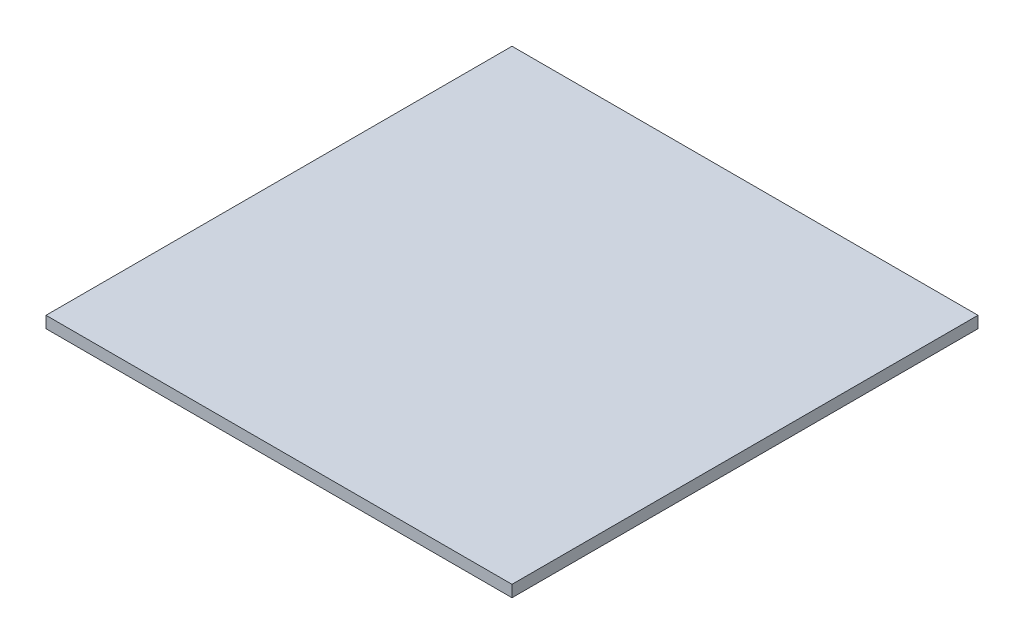
ISO-10303-21;
HEADER;
FILE_DESCRIPTION(('STEP AP214'),'2;1');
FILE_NAME('part.step','',(''),(''),'','','');
FILE_SCHEMA(('AUTOMOTIVE_DESIGN { 1 0 10303 214 1 1 1 1 }'));
ENDSEC;
DATA;
#1=APPLICATION_CONTEXT('core data for automotive mechanical design processes');
#2=APPLICATION_PROTOCOL_DEFINITION('international standard','automotive_design',2000,#1);
#3=PRODUCT_CONTEXT('',#1,'mechanical');
#4=PRODUCT('Part','Part','',(#3));
#5=PRODUCT_RELATED_PRODUCT_CATEGORY('part','',(#4));
#6=PRODUCT_DEFINITION_FORMATION('','',#4);
#7=PRODUCT_DEFINITION_CONTEXT('part definition',#1,'design');
#8=PRODUCT_DEFINITION('design','',#6,#7);
#9=PRODUCT_DEFINITION_SHAPE('','',#8);
#10=(LENGTH_UNIT() NAMED_UNIT(*) SI_UNIT(.MILLI.,.METRE.));
#11=(NAMED_UNIT(*) PLANE_ANGLE_UNIT() SI_UNIT($,.RADIAN.));
#12=(NAMED_UNIT(*) SI_UNIT($,.STERADIAN.) SOLID_ANGLE_UNIT());
#13=UNCERTAINTY_MEASURE_WITH_UNIT(LENGTH_MEASURE(1.E-05),#10,'distance_accuracy_value','');
#14=(GEOMETRIC_REPRESENTATION_CONTEXT(3) GLOBAL_UNCERTAINTY_ASSIGNED_CONTEXT((#13)) GLOBAL_UNIT_ASSIGNED_CONTEXT((#10,
#11,#12)) REPRESENTATION_CONTEXT('',''));
#15=CARTESIAN_POINT('',(0.,0.,0.));
#16=DIRECTION('',(0.,0.,1.));
#17=DIRECTION('',(1.,0.,0.));
#18=AXIS2_PLACEMENT_3D('',#15,#16,#17);
#19=CARTESIAN_POINT('',(-200.,10.,-200.));
#20=DIRECTION('',(1.,0.,0.));
#21=DIRECTION('',(0.,0.,-1.));
#22=AXIS2_PLACEMENT_3D('',#19,#20,#21);
#23=PLANE('',#22);
#24=DIRECTION('',(0.,0.,1.));
#25=VECTOR('',#24,1.);
#26=CARTESIAN_POINT('',(-200.,0.,-200.));
#27=LINE('',#26,#25);
#28=CARTESIAN_POINT('',(-200.,0.,-200.));
#29=VERTEX_POINT('',#28);
#30=CARTESIAN_POINT('',(-200.,0.,200.));
#31=VERTEX_POINT('',#30);
#32=EDGE_CURVE('E97',#29,#31,#27,.T.);
#33=ORIENTED_EDGE('',*,*,#32,.T.);
#34=DIRECTION('',(0.,-1.,0.));
#35=VECTOR('',#34,1.);
#36=CARTESIAN_POINT('',(-200.,10.,200.));
#37=LINE('',#36,#35);
#38=CARTESIAN_POINT('',(-200.,10.,200.));
#39=VERTEX_POINT('',#38);
#40=EDGE_CURVE('E11',#39,#31,#37,.T.);
#41=ORIENTED_EDGE('',*,*,#40,.F.);
#42=DIRECTION('',(0.,0.,1.));
#43=VECTOR('',#42,1.);
#44=CARTESIAN_POINT('',(-200.,10.,-200.));
#45=LINE('',#44,#43);
#46=CARTESIAN_POINT('',(-200.,10.,-200.));
#47=VERTEX_POINT('',#46);
#48=EDGE_CURVE('E85',#47,#39,#45,.T.);
#49=ORIENTED_EDGE('',*,*,#48,.F.);
#50=DIRECTION('',(0.,-1.,0.));
#51=VECTOR('',#50,1.);
#52=CARTESIAN_POINT('',(-200.,10.,-200.));
#53=LINE('',#52,#51);
#54=EDGE_CURVE('E93',#47,#29,#53,.T.);
#55=ORIENTED_EDGE('',*,*,#54,.T.);
#56=EDGE_LOOP('',(#33,#41,#49,#55));
#57=FACE_BOUND('',#56,.T.);
#58=ADVANCED_FACE('F34',(#57),#23,.F.);
#59=CARTESIAN_POINT('',(-200.,10.,200.));
#60=DIRECTION('',(0.,0.,-1.));
#61=DIRECTION('',(-1.,0.,0.));
#62=AXIS2_PLACEMENT_3D('',#59,#60,#61);
#63=PLANE('',#62);
#64=DIRECTION('',(1.,0.,0.));
#65=VECTOR('',#64,1.);
#66=CARTESIAN_POINT('',(-200.,0.,200.));
#67=LINE('',#66,#65);
#68=CARTESIAN_POINT('',(200.,0.,200.));
#69=VERTEX_POINT('',#68);
#70=EDGE_CURVE('E89',#31,#69,#67,.T.);
#71=ORIENTED_EDGE('',*,*,#70,.T.);
#72=DIRECTION('',(0.,-1.,0.));
#73=VECTOR('',#72,1.);
#74=CARTESIAN_POINT('',(200.,10.,200.));
#75=LINE('',#74,#73);
#76=CARTESIAN_POINT('',(200.,10.,200.));
#77=VERTEX_POINT('',#76);
#78=EDGE_CURVE('E42',#77,#69,#75,.T.);
#79=ORIENTED_EDGE('',*,*,#78,.F.);
#80=DIRECTION('',(1.,0.,0.));
#81=VECTOR('',#80,1.);
#82=CARTESIAN_POINT('',(-200.,10.,200.));
#83=LINE('',#82,#81);
#84=EDGE_CURVE('E80',#39,#77,#83,.T.);
#85=ORIENTED_EDGE('',*,*,#84,.F.);
#86=ORIENTED_EDGE('',*,*,#40,.T.);
#87=EDGE_LOOP('',(#71,#79,#85,#86));
#88=FACE_BOUND('',#87,.T.);
#89=ADVANCED_FACE('F88',(#88),#63,.F.);
#90=CARTESIAN_POINT('',(200.,10.,-200.));
#91=DIRECTION('',(-1.,0.,0.));
#92=DIRECTION('',(0.,0.,1.));
#93=AXIS2_PLACEMENT_3D('',#90,#91,#92);
#94=PLANE('',#93);
#95=DIRECTION('',(0.,0.,-1.));
#96=VECTOR('',#95,1.);
#97=CARTESIAN_POINT('',(200.,0.,-200.));
#98=LINE('',#97,#96);
#99=CARTESIAN_POINT('',(200.,0.,-200.));
#100=VERTEX_POINT('',#99);
#101=EDGE_CURVE('E67',#69,#100,#98,.T.);
#102=ORIENTED_EDGE('',*,*,#101,.T.);
#103=DIRECTION('',(0.,-1.,0.));
#104=VECTOR('',#103,1.);
#105=CARTESIAN_POINT('',(200.,10.,-200.));
#106=LINE('',#105,#104);
#107=CARTESIAN_POINT('',(200.,10.,-200.));
#108=VERTEX_POINT('',#107);
#109=EDGE_CURVE('E90',#108,#100,#106,.T.);
#110=ORIENTED_EDGE('',*,*,#109,.F.);
#111=DIRECTION('',(0.,0.,-1.));
#112=VECTOR('',#111,1.);
#113=CARTESIAN_POINT('',(200.,10.,-200.));
#114=LINE('',#113,#112);
#115=EDGE_CURVE('E83',#77,#108,#114,.T.);
#116=ORIENTED_EDGE('',*,*,#115,.F.);
#117=ORIENTED_EDGE('',*,*,#78,.T.);
#118=EDGE_LOOP('',(#102,#110,#116,#117));
#119=FACE_BOUND('',#118,.T.);
#120=ADVANCED_FACE('F91',(#119),#94,.F.);
#121=CARTESIAN_POINT('',(-200.,10.,-200.));
#122=DIRECTION('',(0.,0.,1.));
#123=DIRECTION('',(1.,0.,0.));
#124=AXIS2_PLACEMENT_3D('',#121,#122,#123);
#125=PLANE('',#124);
#126=DIRECTION('',(-1.,0.,0.));
#127=VECTOR('',#126,1.);
#128=CARTESIAN_POINT('',(-200.,0.,-200.));
#129=LINE('',#128,#127);
#130=EDGE_CURVE('E73',#100,#29,#129,.T.);
#131=ORIENTED_EDGE('',*,*,#130,.T.);
#132=ORIENTED_EDGE('',*,*,#54,.F.);
#133=DIRECTION('',(-1.,0.,0.));
#134=VECTOR('',#133,1.);
#135=CARTESIAN_POINT('',(-200.,10.,-200.));
#136=LINE('',#135,#134);
#137=EDGE_CURVE('E50',#108,#47,#136,.T.);
#138=ORIENTED_EDGE('',*,*,#137,.F.);
#139=ORIENTED_EDGE('',*,*,#109,.T.);
#140=EDGE_LOOP('',(#131,#132,#138,#139));
#141=FACE_BOUND('',#140,.T.);
#142=ADVANCED_FACE('F104',(#141),#125,.F.);
#143=CARTESIAN_POINT('',(0.,10.,0.));
#144=DIRECTION('',(0.,1.,0.));
#145=DIRECTION('',(0.,0.,1.));
#146=AXIS2_PLACEMENT_3D('',#143,#144,#145);
#147=PLANE('',#146);
#148=ORIENTED_EDGE('',*,*,#48,.T.);
#149=ORIENTED_EDGE('',*,*,#84,.T.);
#150=ORIENTED_EDGE('',*,*,#115,.T.);
#151=ORIENTED_EDGE('',*,*,#137,.T.);
#152=EDGE_LOOP('',(#148,#149,#150,#151));
#153=FACE_BOUND('',#152,.T.);
#154=ADVANCED_FACE('F81',(#153),#147,.T.);
#155=CARTESIAN_POINT('',(0.,0.,0.));
#156=DIRECTION('',(0.,1.,0.));
#157=DIRECTION('',(0.,0.,1.));
#158=AXIS2_PLACEMENT_3D('',#155,#156,#157);
#159=PLANE('',#158);
#160=ORIENTED_EDGE('',*,*,#32,.F.);
#161=ORIENTED_EDGE('',*,*,#130,.F.);
#162=ORIENTED_EDGE('',*,*,#101,.F.);
#163=ORIENTED_EDGE('',*,*,#70,.F.);
#164=EDGE_LOOP('',(#160,#161,#162,#163));
#165=FACE_BOUND('',#164,.T.);
#166=ADVANCED_FACE('F107',(#165),#159,.F.);
#167=CLOSED_SHELL('',(#58,#89,#120,#142,#154,#166));
#168=MANIFOLD_SOLID_BREP('B2',#167);
#169=ADVANCED_BREP_SHAPE_REPRESENTATION('',(#18,#168),#14);
#170=SHAPE_DEFINITION_REPRESENTATION(#9,#169);
ENDSEC;
END-ISO-10303-21;
